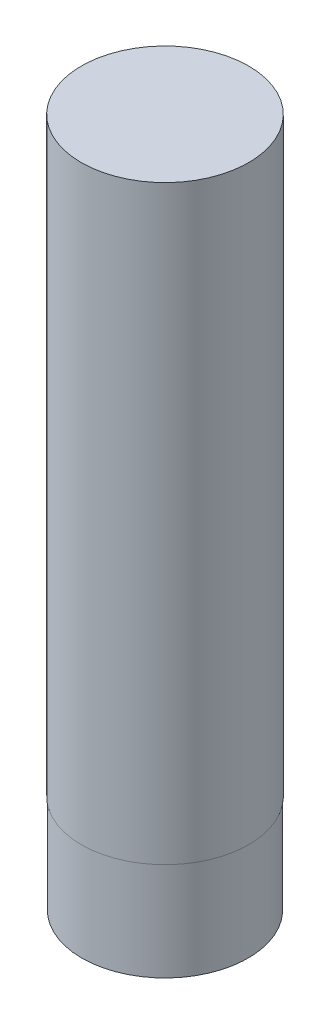
ISO-10303-21;
HEADER;
FILE_DESCRIPTION(('STEP AP214'),'2;1');
FILE_NAME('part.step','',(''),(''),'','','');
FILE_SCHEMA(('AUTOMOTIVE_DESIGN { 1 0 10303 214 1 1 1 1 }'));
ENDSEC;
DATA;
#1=APPLICATION_CONTEXT('core data for automotive mechanical design processes');
#2=APPLICATION_PROTOCOL_DEFINITION('international standard','automotive_design',2000,#1);
#3=PRODUCT_CONTEXT('',#1,'mechanical');
#4=PRODUCT('Part','Part','',(#3));
#5=PRODUCT_RELATED_PRODUCT_CATEGORY('part','',(#4));
#6=PRODUCT_DEFINITION_FORMATION('','',#4);
#7=PRODUCT_DEFINITION_CONTEXT('part definition',#1,'design');
#8=PRODUCT_DEFINITION('design','',#6,#7);
#9=PRODUCT_DEFINITION_SHAPE('','',#8);
#10=(LENGTH_UNIT() NAMED_UNIT(*) SI_UNIT(.MILLI.,.METRE.));
#11=(NAMED_UNIT(*) PLANE_ANGLE_UNIT() SI_UNIT($,.RADIAN.));
#12=(NAMED_UNIT(*) SI_UNIT($,.STERADIAN.) SOLID_ANGLE_UNIT());
#13=UNCERTAINTY_MEASURE_WITH_UNIT(LENGTH_MEASURE(1.E-05),#10,'distance_accuracy_value','');
#14=(GEOMETRIC_REPRESENTATION_CONTEXT(3) GLOBAL_UNCERTAINTY_ASSIGNED_CONTEXT((#13)) GLOBAL_UNIT_ASSIGNED_CONTEXT((#10,
#11,#12)) REPRESENTATION_CONTEXT('',''));
#15=CARTESIAN_POINT('',(0.,0.,0.));
#16=DIRECTION('',(0.,0.,1.));
#17=DIRECTION('',(1.,0.,0.));
#18=AXIS2_PLACEMENT_3D('',#15,#16,#17);
#19=CARTESIAN_POINT('',(0.,60.,0.));
#20=DIRECTION('',(0.,-1.,0.));
#21=DIRECTION('',(0.,0.,-1.));
#22=AXIS2_PLACEMENT_3D('',#19,#20,#21);
#23=CYLINDRICAL_SURFACE('',#22,8.5);
#24=CARTESIAN_POINT('',(0.,60.,0.));
#25=DIRECTION('',(0.,1.,0.));
#26=DIRECTION('',(0.,0.,1.));
#27=AXIS2_PLACEMENT_3D('',#24,#25,#26);
#28=CIRCLE('',#27,8.5);
#29=CARTESIAN_POINT('',(0.,60.,8.5));
#30=VERTEX_POINT('',#29);
#31=EDGE_CURVE('E39',#30,#30,#28,.T.);
#32=ORIENTED_EDGE('',*,*,#31,.F.);
#33=EDGE_LOOP('',(#32));
#34=FACE_BOUND('',#33,.T.);
#35=CARTESIAN_POINT('',(0.,0.,0.));
#36=DIRECTION('',(0.,1.,0.));
#37=DIRECTION('',(0.,0.,1.));
#38=AXIS2_PLACEMENT_3D('',#35,#36,#37);
#39=CIRCLE('',#38,8.5);
#40=CARTESIAN_POINT('',(0.,0.,8.5));
#41=VERTEX_POINT('',#40);
#42=EDGE_CURVE('E35',#41,#41,#39,.T.);
#43=ORIENTED_EDGE('',*,*,#42,.T.);
#44=EDGE_LOOP('',(#43));
#45=FACE_BOUND('',#44,.T.);
#46=ADVANCED_FACE('F32',(#34,#45),#23,.T.);
#47=CARTESIAN_POINT('',(0.,60.,0.));
#48=DIRECTION('',(0.,1.,0.));
#49=DIRECTION('',(0.,0.,1.));
#50=AXIS2_PLACEMENT_3D('',#47,#48,#49);
#51=PLANE('',#50);
#52=ORIENTED_EDGE('',*,*,#31,.T.);
#53=EDGE_LOOP('',(#52));
#54=FACE_BOUND('',#53,.T.);
#55=ADVANCED_FACE('F56',(#54),#51,.T.);
#56=CARTESIAN_POINT('',(0.,0.,0.));
#57=DIRECTION('',(0.,1.,0.));
#58=DIRECTION('',(0.,0.,1.));
#59=AXIS2_PLACEMENT_3D('',#56,#57,#58);
#60=PLANE('',#59);
#61=CARTESIAN_POINT('',(0.,0.,0.));
#62=DIRECTION('',(0.,-1.,0.));
#63=DIRECTION('',(0.,0.,-1.));
#64=AXIS2_PLACEMENT_3D('',#61,#62,#63);
#65=CIRCLE('',#64,8.45);
#66=CARTESIAN_POINT('',(0.,0.,-8.45));
#67=VERTEX_POINT('',#66);
#68=EDGE_CURVE('E10',#67,#67,#65,.T.);
#69=ORIENTED_EDGE('',*,*,#68,.F.);
#70=EDGE_LOOP('',(#69));
#71=FACE_BOUND('',#70,.T.);
#72=ORIENTED_EDGE('',*,*,#42,.F.);
#73=EDGE_LOOP('',(#72));
#74=FACE_BOUND('',#73,.T.);
#75=ADVANCED_FACE('F53',(#71,#74),#60,.F.);
#76=CARTESIAN_POINT('',(0.,-10.,0.));
#77=DIRECTION('',(0.,1.,0.));
#78=DIRECTION('',(0.,0.,1.));
#79=AXIS2_PLACEMENT_3D('',#76,#77,#78);
#80=CYLINDRICAL_SURFACE('',#79,8.45);
#81=CARTESIAN_POINT('',(0.,-10.,0.));
#82=DIRECTION('',(0.,-1.,0.));
#83=DIRECTION('',(0.,0.,-1.));
#84=AXIS2_PLACEMENT_3D('',#81,#82,#83);
#85=CIRCLE('',#84,8.45);
#86=CARTESIAN_POINT('',(0.,-10.,-8.45));
#87=VERTEX_POINT('',#86);
#88=EDGE_CURVE('E45',#87,#87,#85,.T.);
#89=ORIENTED_EDGE('',*,*,#88,.F.);
#90=EDGE_LOOP('',(#89));
#91=FACE_BOUND('',#90,.T.);
#92=ORIENTED_EDGE('',*,*,#68,.T.);
#93=EDGE_LOOP('',(#92));
#94=FACE_BOUND('',#93,.T.);
#95=ADVANCED_FACE('F55',(#91,#94),#80,.T.);
#96=CARTESIAN_POINT('',(0.,-10.,0.));
#97=DIRECTION('',(0.,-1.,0.));
#98=DIRECTION('',(0.,0.,-1.));
#99=AXIS2_PLACEMENT_3D('',#96,#97,#98);
#100=PLANE('',#99);
#101=ORIENTED_EDGE('',*,*,#88,.T.);
#102=EDGE_LOOP('',(#101));
#103=FACE_BOUND('',#102,.T.);
#104=ADVANCED_FACE('F62',(#103),#100,.T.);
#105=CLOSED_SHELL('',(#46,#55,#75,#95,#104));
#106=MANIFOLD_SOLID_BREP('B2',#105);
#107=ADVANCED_BREP_SHAPE_REPRESENTATION('',(#18,#106),#14);
#108=SHAPE_DEFINITION_REPRESENTATION(#9,#107);
ENDSEC;
END-ISO-10303-21;
